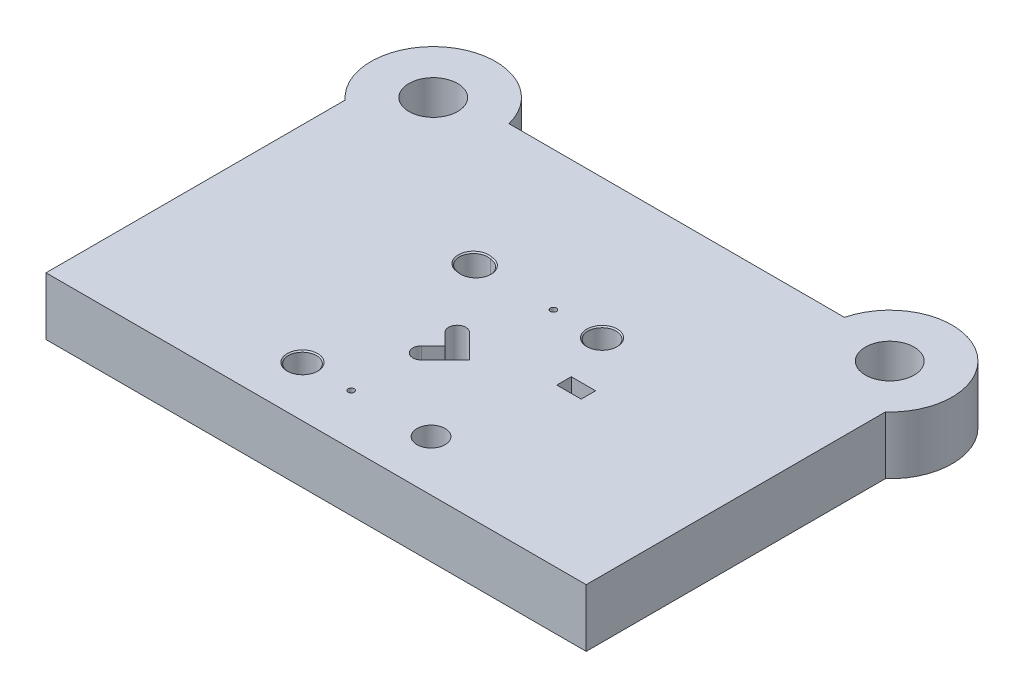
ISO-10303-21;
HEADER;
FILE_DESCRIPTION(('STEP AP214'),'2;1');
FILE_NAME('part.step','',(''),(''),'','','');
FILE_SCHEMA(('AUTOMOTIVE_DESIGN { 1 0 10303 214 1 1 1 1 }'));
ENDSEC;
DATA;
#1=APPLICATION_CONTEXT('core data for automotive mechanical design processes');
#2=APPLICATION_PROTOCOL_DEFINITION('international standard','automotive_design',2000,#1);
#3=PRODUCT_CONTEXT('',#1,'mechanical');
#4=PRODUCT('Part','Part','',(#3));
#5=PRODUCT_RELATED_PRODUCT_CATEGORY('part','',(#4));
#6=PRODUCT_DEFINITION_FORMATION('','',#4);
#7=PRODUCT_DEFINITION_CONTEXT('part definition',#1,'design');
#8=PRODUCT_DEFINITION('design','',#6,#7);
#9=PRODUCT_DEFINITION_SHAPE('','',#8);
#10=(LENGTH_UNIT() NAMED_UNIT(*) SI_UNIT(.MILLI.,.METRE.));
#11=(NAMED_UNIT(*) PLANE_ANGLE_UNIT() SI_UNIT($,.RADIAN.));
#12=(NAMED_UNIT(*) SI_UNIT($,.STERADIAN.) SOLID_ANGLE_UNIT());
#13=UNCERTAINTY_MEASURE_WITH_UNIT(LENGTH_MEASURE(1.E-05),#10,'distance_accuracy_value','');
#14=(GEOMETRIC_REPRESENTATION_CONTEXT(3) GLOBAL_UNCERTAINTY_ASSIGNED_CONTEXT((#13)) GLOBAL_UNIT_ASSIGNED_CONTEXT((#10,
#11,#12)) REPRESENTATION_CONTEXT('',''));
#15=CARTESIAN_POINT('',(0.,0.,0.));
#16=DIRECTION('',(0.,0.,1.));
#17=DIRECTION('',(1.,0.,0.));
#18=AXIS2_PLACEMENT_3D('',#15,#16,#17);
#19=CARTESIAN_POINT('',(-150.,0.,-227.));
#20=DIRECTION('',(0.,1.,0.));
#21=DIRECTION('',(0.,0.,1.));
#22=AXIS2_PLACEMENT_3D('',#19,#20,#21);
#23=PLANE('',#22);
#24=CARTESIAN_POINT('',(-42.25,0.,-33.3));
#25=DIRECTION('',(0.,-1.,0.));
#26=DIRECTION('',(0.,0.,-1.));
#27=AXIS2_PLACEMENT_3D('',#24,#25,#26);
#28=CIRCLE('',#27,9.24999999999999);
#29=CARTESIAN_POINT('',(-42.25,0.,-42.55));
#30=VERTEX_POINT('',#29);
#31=EDGE_CURVE('E437',#30,#30,#28,.T.);
#32=ORIENTED_EDGE('',*,*,#31,.F.);
#33=EDGE_LOOP('',(#32));
#34=FACE_BOUND('',#33,.T.);
#35=CARTESIAN_POINT('',(42.25,0.,-33.3));
#36=DIRECTION('',(0.,-1.,0.));
#37=DIRECTION('',(0.,0.,-1.));
#38=AXIS2_PLACEMENT_3D('',#35,#36,#37);
#39=CIRCLE('',#38,9.24999999999999);
#40=CARTESIAN_POINT('',(42.25,0.,-42.55));
#41=VERTEX_POINT('',#40);
#42=EDGE_CURVE('E434',#41,#41,#39,.T.);
#43=ORIENTED_EDGE('',*,*,#42,.F.);
#44=EDGE_LOOP('',(#43));
#45=FACE_BOUND('',#44,.T.);
#46=CARTESIAN_POINT('',(42.25,0.,-145.68));
#47=DIRECTION('',(0.,-1.,0.));
#48=DIRECTION('',(0.,0.,-1.));
#49=AXIS2_PLACEMENT_3D('',#46,#47,#48);
#50=CIRCLE('',#49,9.24999999999999);
#51=CARTESIAN_POINT('',(42.25,0.,-154.93));
#52=VERTEX_POINT('',#51);
#53=EDGE_CURVE('E428',#52,#52,#50,.T.);
#54=ORIENTED_EDGE('',*,*,#53,.F.);
#55=EDGE_LOOP('',(#54));
#56=FACE_BOUND('',#55,.T.);
#57=CARTESIAN_POINT('',(150.,0.,-227.));
#58=DIRECTION('',(0.,1.,0.));
#59=DIRECTION('',(0.,0.,-1.));
#60=AXIS2_PLACEMENT_3D('',#57,#58,#59);
#61=CIRCLE('',#60,16.);
#62=CARTESIAN_POINT('',(150.,0.,-243.));
#63=VERTEX_POINT('',#62);
#64=EDGE_CURVE('E322',#63,#63,#61,.T.);
#65=ORIENTED_EDGE('',*,*,#64,.T.);
#66=EDGE_LOOP('',(#65));
#67=FACE_BOUND('',#66,.T.);
#68=CARTESIAN_POINT('',(-150.,0.,-227.));
#69=DIRECTION('',(0.,1.,0.));
#70=DIRECTION('',(0.,0.,1.));
#71=AXIS2_PLACEMENT_3D('',#68,#69,#70);
#72=CIRCLE('',#71,16.);
#73=CARTESIAN_POINT('',(-150.,0.,-211.));
#74=VERTEX_POINT('',#73);
#75=EDGE_CURVE('E314',#74,#74,#72,.T.);
#76=ORIENTED_EDGE('',*,*,#75,.T.);
#77=EDGE_LOOP('',(#76));
#78=FACE_BOUND('',#77,.T.);
#79=DIRECTION('',(0.,0.,1.));
#80=VECTOR('',#79,1.);
#81=CARTESIAN_POINT('',(-177.5,0.,0.));
#82=LINE('',#81,#80);
#83=CARTESIAN_POINT('',(-177.5,0.,-196.59029760093));
#84=VERTEX_POINT('',#83);
#85=CARTESIAN_POINT('',(-177.5,0.,0.));
#86=VERTEX_POINT('',#85);
#87=EDGE_CURVE('E271',#84,#86,#82,.T.);
#88=ORIENTED_EDGE('',*,*,#87,.F.);
#89=CARTESIAN_POINT('',(-150.,0.,-227.));
#90=DIRECTION('',(0.,1.,0.));
#91=DIRECTION('',(0.,0.,1.));
#92=AXIS2_PLACEMENT_3D('',#89,#90,#91);
#93=CIRCLE('',#92,41.);
#94=CARTESIAN_POINT('',(-110.238209295858,0.,-237.));
#95=VERTEX_POINT('',#94);
#96=EDGE_CURVE('E287',#95,#84,#93,.T.);
#97=ORIENTED_EDGE('',*,*,#96,.F.);
#98=DIRECTION('',(-1.,0.,0.));
#99=VECTOR('',#98,1.);
#100=CARTESIAN_POINT('',(110.238209295858,0.,-237.));
#101=LINE('',#100,#99);
#102=CARTESIAN_POINT('',(110.238209295858,0.,-237.));
#103=VERTEX_POINT('',#102);
#104=EDGE_CURVE('E282',#103,#95,#101,.T.);
#105=ORIENTED_EDGE('',*,*,#104,.F.);
#106=CARTESIAN_POINT('',(150.,0.,-227.));
#107=DIRECTION('',(0.,1.,0.));
#108=DIRECTION('',(0.,0.,-1.));
#109=AXIS2_PLACEMENT_3D('',#106,#107,#108);
#110=CIRCLE('',#109,41.);
#111=CARTESIAN_POINT('',(177.5,0.,-196.59029760093));
#112=VERTEX_POINT('',#111);
#113=EDGE_CURVE('E280',#112,#103,#110,.T.);
#114=ORIENTED_EDGE('',*,*,#113,.F.);
#115=DIRECTION('',(0.,0.,-1.));
#116=VECTOR('',#115,1.);
#117=CARTESIAN_POINT('',(177.5,0.,0.));
#118=LINE('',#117,#116);
#119=CARTESIAN_POINT('',(177.5,0.,0.));
#120=VERTEX_POINT('',#119);
#121=EDGE_CURVE('E270',#120,#112,#118,.T.);
#122=ORIENTED_EDGE('',*,*,#121,.F.);
#123=DIRECTION('',(1.,0.,0.));
#124=VECTOR('',#123,1.);
#125=CARTESIAN_POINT('',(177.5,0.,0.));
#126=LINE('',#125,#124);
#127=EDGE_CURVE('E262',#86,#120,#126,.T.);
#128=ORIENTED_EDGE('',*,*,#127,.F.);
#129=EDGE_LOOP('',(#88,#97,#105,#114,#122,#128));
#130=FACE_BOUND('',#129,.T.);
#131=CARTESIAN_POINT('',(-10.25,0.,-33.3));
#132=DIRECTION('',(0.,-1.,0.));
#133=DIRECTION('',(0.,0.,-1.));
#134=AXIS2_PLACEMENT_3D('',#131,#132,#133);
#135=CIRCLE('',#134,1.99);
#136=CARTESIAN_POINT('',(-10.25,0.,-35.29));
#137=VERTEX_POINT('',#136);
#138=EDGE_CURVE('E368',#137,#137,#135,.T.);
#139=ORIENTED_EDGE('',*,*,#138,.F.);
#140=EDGE_LOOP('',(#139));
#141=FACE_BOUND('',#140,.T.);
#142=CARTESIAN_POINT('',(10.25,0.,-145.68));
#143=DIRECTION('',(0.,-1.,0.));
#144=DIRECTION('',(0.,0.,-1.));
#145=AXIS2_PLACEMENT_3D('',#142,#143,#144);
#146=CIRCLE('',#145,1.99000000000002);
#147=CARTESIAN_POINT('',(10.25,0.,-147.67));
#148=VERTEX_POINT('',#147);
#149=EDGE_CURVE('E374',#148,#148,#146,.T.);
#150=ORIENTED_EDGE('',*,*,#149,.F.);
#151=EDGE_LOOP('',(#150));
#152=FACE_BOUND('',#151,.T.);
#153=DIRECTION('',(-0.707106781186548,0.,-0.707106781186548));
#154=VECTOR('',#153,1.);
#155=CARTESIAN_POINT('',(-4.81282538143907,0.,-89.5182842712474));
#156=LINE('',#155,#154);
#157=CARTESIAN_POINT('',(-4.81282538143912,0.,-89.5182842712474));
#158=VERTEX_POINT('',#157);
#159=CARTESIAN_POINT('',(-12.5344314319962,0.,-97.2398903218045));
#160=VERTEX_POINT('',#159);
#161=EDGE_CURVE('E407',#158,#160,#156,.T.);
#162=ORIENTED_EDGE('',*,*,#161,.F.);
#163=DIRECTION('',(0.707106781186548,0.,-0.707106781186547));
#164=VECTOR('',#163,1.);
#165=CARTESIAN_POINT('',(-12.5344314319962,0.,-81.7966782206903));
#166=LINE('',#165,#164);
#167=CARTESIAN_POINT('',(-12.5344314319962,0.,-81.7966782206903));
#168=VERTEX_POINT('',#167);
#169=EDGE_CURVE('E380',#168,#158,#166,.T.);
#170=ORIENTED_EDGE('',*,*,#169,.F.);
#171=CARTESIAN_POINT('',(-8.51806491485659,0.,-77.7803117035508));
#172=DIRECTION('',(0.,-1.,0.));
#173=DIRECTION('',(0.,0.,-1.));
#174=AXIS2_PLACEMENT_3D('',#171,#172,#173);
#175=CIRCLE('',#174,5.68);
#176=CARTESIAN_POINT('',(-4.501698397717,0.,-73.7639451864112));
#177=VERTEX_POINT('',#176);
#178=EDGE_CURVE('E394',#177,#168,#175,.T.);
#179=ORIENTED_EDGE('',*,*,#178,.F.);
#180=DIRECTION('',(-0.707106781186547,0.,0.707106781186548));
#181=VECTOR('',#180,1.);
#182=CARTESIAN_POINT('',(11.2526406871193,0.,-89.5182842712474));
#183=LINE('',#182,#181);
#184=CARTESIAN_POINT('',(11.2526406871193,0.,-89.5182842712474));
#185=VERTEX_POINT('',#184);
#186=EDGE_CURVE('E398',#185,#177,#183,.T.);
#187=ORIENTED_EDGE('',*,*,#186,.F.);
#188=DIRECTION('',(0.707106781186547,0.,0.707106781186548));
#189=VECTOR('',#188,1.);
#190=CARTESIAN_POINT('',(-4.50169839771699,0.,-105.272623356084));
#191=LINE('',#190,#189);
#192=CARTESIAN_POINT('',(-4.50169839771699,0.,-105.272623356084));
#193=VERTEX_POINT('',#192);
#194=EDGE_CURVE('E401',#193,#185,#191,.T.);
#195=ORIENTED_EDGE('',*,*,#194,.F.);
#196=CARTESIAN_POINT('',(-8.51806491485659,0.,-101.256256838944));
#197=DIRECTION('',(0.,-1.,0.));
#198=DIRECTION('',(0.,0.,-1.));
#199=AXIS2_PLACEMENT_3D('',#196,#197,#198);
#200=CIRCLE('',#199,5.68000000000001);
#201=EDGE_CURVE('E404',#160,#193,#200,.T.);
#202=ORIENTED_EDGE('',*,*,#201,.F.);
#203=EDGE_LOOP('',(#162,#170,#179,#187,#195,#202));
#204=FACE_BOUND('',#203,.T.);
#205=DIRECTION('',(1.,0.,0.));
#206=VECTOR('',#205,1.);
#207=CARTESIAN_POINT('',(54.25,0.,-113.43));
#208=LINE('',#207,#206);
#209=CARTESIAN_POINT('',(54.25,0.,-113.43));
#210=VERTEX_POINT('',#209);
#211=CARTESIAN_POINT('',(70.25,0.,-113.43));
#212=VERTEX_POINT('',#211);
#213=EDGE_CURVE('E354',#210,#212,#208,.T.);
#214=ORIENTED_EDGE('',*,*,#213,.F.);
#215=DIRECTION('',(0.,0.,-1.));
#216=VECTOR('',#215,1.);
#217=CARTESIAN_POINT('',(54.25,0.,-103.93));
#218=LINE('',#217,#216);
#219=CARTESIAN_POINT('',(54.25,0.,-103.93));
#220=VERTEX_POINT('',#219);
#221=EDGE_CURVE('E357',#220,#210,#218,.T.);
#222=ORIENTED_EDGE('',*,*,#221,.F.);
#223=DIRECTION('',(-1.,0.,0.));
#224=VECTOR('',#223,1.);
#225=CARTESIAN_POINT('',(70.25,0.,-103.93));
#226=LINE('',#225,#224);
#227=CARTESIAN_POINT('',(70.25,0.,-103.93));
#228=VERTEX_POINT('',#227);
#229=EDGE_CURVE('E347',#228,#220,#226,.T.);
#230=ORIENTED_EDGE('',*,*,#229,.F.);
#231=DIRECTION('',(0.,0.,1.));
#232=VECTOR('',#231,1.);
#233=CARTESIAN_POINT('',(70.25,0.,-113.43));
#234=LINE('',#233,#232);
#235=EDGE_CURVE('E351',#212,#228,#234,.T.);
#236=ORIENTED_EDGE('',*,*,#235,.F.);
#237=EDGE_LOOP('',(#214,#222,#230,#236));
#238=FACE_BOUND('',#237,.T.);
#239=CARTESIAN_POINT('',(-42.25,0.,-145.68));
#240=DIRECTION('',(0.,-1.,0.));
#241=DIRECTION('',(0.,0.,-1.));
#242=AXIS2_PLACEMENT_3D('',#239,#240,#241);
#243=CIRCLE('',#242,9.24999999999999);
#244=CARTESIAN_POINT('',(-42.7195034447814,0.,-136.441923007718));
#245=VERTEX_POINT('',#244);
#246=CARTESIAN_POINT('',(-39.9704323244489,0.,-154.644712556049));
#247=VERTEX_POINT('',#246);
#248=EDGE_CURVE('E196',#245,#247,#243,.T.);
#249=ORIENTED_EDGE('',*,*,#248,.F.);
#250=CARTESIAN_POINT('',(-40.4399357692302,0.,-145.406635563767));
#251=DIRECTION('',(0.,1.,0.));
#252=DIRECTION('',(0.,0.,1.));
#253=AXIS2_PLACEMENT_3D('',#250,#251,#252);
#254=CIRCLE('',#253,9.25);
#255=EDGE_CURVE('E191',#245,#247,#254,.T.);
#256=ORIENTED_EDGE('',*,*,#255,.T.);
#257=EDGE_LOOP('',(#249,#256));
#258=FACE_BOUND('',#257,.T.);
#259=ADVANCED_FACE('F35',(#34,#45,#56,#67,#78,#130,#141,#152,#204,#238,#258),#23,.F.);
#260=CARTESIAN_POINT('',(-150.,38.,-227.));
#261=DIRECTION('',(0.,1.,0.));
#262=DIRECTION('',(0.,0.,1.));
#263=AXIS2_PLACEMENT_3D('',#260,#261,#262);
#264=PLANE('',#263);
#265=CARTESIAN_POINT('',(42.25,38.,-145.68));
#266=DIRECTION('',(0.,1.,0.));
#267=DIRECTION('',(0.,0.,1.));
#268=AXIS2_PLACEMENT_3D('',#265,#266,#267);
#269=CIRCLE('',#268,10.025);
#270=CARTESIAN_POINT('',(42.25,38.,-135.655));
#271=VERTEX_POINT('',#270);
#272=EDGE_CURVE('E451',#271,#271,#269,.T.);
#273=ORIENTED_EDGE('',*,*,#272,.F.);
#274=EDGE_LOOP('',(#273));
#275=FACE_BOUND('',#274,.T.);
#276=CARTESIAN_POINT('',(-42.25,38.,-145.68));
#277=DIRECTION('',(0.,1.,0.));
#278=DIRECTION('',(0.,0.,1.));
#279=AXIS2_PLACEMENT_3D('',#276,#277,#278);
#280=CIRCLE('',#279,10.025);
#281=CARTESIAN_POINT('',(-39.8541742036583,38.,-155.41450788451));
#282=VERTEX_POINT('',#281);
#283=CARTESIAN_POINT('',(-42.8357615655719,38.,-135.672127679257));
#284=VERTEX_POINT('',#283);
#285=EDGE_CURVE('E56',#282,#284,#280,.T.);
#286=ORIENTED_EDGE('',*,*,#285,.F.);
#287=CARTESIAN_POINT('',(-40.4399357692302,38.,-145.406635563767));
#288=DIRECTION('',(0.,1.,0.));
#289=DIRECTION('',(0.,0.,1.));
#290=AXIS2_PLACEMENT_3D('',#287,#288,#289);
#291=CIRCLE('',#290,10.025);
#292=EDGE_CURVE('E185',#284,#282,#291,.T.);
#293=ORIENTED_EDGE('',*,*,#292,.F.);
#294=EDGE_LOOP('',(#286,#293));
#295=FACE_BOUND('',#294,.T.);
#296=CARTESIAN_POINT('',(-42.2499999999999,38.,-33.3));
#297=DIRECTION('',(0.,1.,0.));
#298=DIRECTION('',(0.,0.,1.));
#299=AXIS2_PLACEMENT_3D('',#296,#297,#298);
#300=CIRCLE('',#299,10.025);
#301=CARTESIAN_POINT('',(-42.2499999999999,38.,-23.275));
#302=VERTEX_POINT('',#301);
#303=EDGE_CURVE('E176',#302,#302,#300,.T.);
#304=ORIENTED_EDGE('',*,*,#303,.F.);
#305=EDGE_LOOP('',(#304));
#306=FACE_BOUND('',#305,.T.);
#307=CARTESIAN_POINT('',(42.25,38.,-33.3));
#308=DIRECTION('',(0.,-1.,0.));
#309=DIRECTION('',(0.,0.,-1.));
#310=AXIS2_PLACEMENT_3D('',#307,#308,#309);
#311=CIRCLE('',#310,9.24999999999999);
#312=CARTESIAN_POINT('',(42.25,38.,-42.55));
#313=VERTEX_POINT('',#312);
#314=EDGE_CURVE('E431',#313,#313,#311,.T.);
#315=ORIENTED_EDGE('',*,*,#314,.T.);
#316=EDGE_LOOP('',(#315));
#317=FACE_BOUND('',#316,.T.);
#318=DIRECTION('',(0.,0.,-1.));
#319=VECTOR('',#318,1.);
#320=CARTESIAN_POINT('',(54.25,38.,-103.93));
#321=LINE('',#320,#319);
#322=CARTESIAN_POINT('',(54.25,38.,-103.93));
#323=VERTEX_POINT('',#322);
#324=CARTESIAN_POINT('',(54.25,38.,-113.43));
#325=VERTEX_POINT('',#324);
#326=EDGE_CURVE('E350',#323,#325,#321,.T.);
#327=ORIENTED_EDGE('',*,*,#326,.T.);
#328=DIRECTION('',(1.,0.,0.));
#329=VECTOR('',#328,1.);
#330=CARTESIAN_POINT('',(54.25,38.,-113.43));
#331=LINE('',#330,#329);
#332=CARTESIAN_POINT('',(70.25,38.,-113.43));
#333=VERTEX_POINT('',#332);
#334=EDGE_CURVE('E363',#325,#333,#331,.T.);
#335=ORIENTED_EDGE('',*,*,#334,.T.);
#336=DIRECTION('',(0.,0.,1.));
#337=VECTOR('',#336,1.);
#338=CARTESIAN_POINT('',(70.25,38.,-113.43));
#339=LINE('',#338,#337);
#340=CARTESIAN_POINT('',(70.25,38.,-103.93));
#341=VERTEX_POINT('',#340);
#342=EDGE_CURVE('E64',#333,#341,#339,.T.);
#343=ORIENTED_EDGE('',*,*,#342,.T.);
#344=DIRECTION('',(-1.,0.,0.));
#345=VECTOR('',#344,1.);
#346=CARTESIAN_POINT('',(70.25,38.,-103.93));
#347=LINE('',#346,#345);
#348=EDGE_CURVE('E342',#341,#323,#347,.T.);
#349=ORIENTED_EDGE('',*,*,#348,.T.);
#350=EDGE_LOOP('',(#327,#335,#343,#349));
#351=FACE_BOUND('',#350,.T.);
#352=DIRECTION('',(0.707106781186548,0.,-0.707106781186547));
#353=VECTOR('',#352,1.);
#354=CARTESIAN_POINT('',(-12.5344314319962,38.,-81.7966782206903));
#355=LINE('',#354,#353);
#356=CARTESIAN_POINT('',(-12.5344314319962,38.,-81.7966782206903));
#357=VERTEX_POINT('',#356);
#358=CARTESIAN_POINT('',(-4.81282538143907,38.,-89.5182842712474));
#359=VERTEX_POINT('',#358);
#360=EDGE_CURVE('E397',#357,#359,#355,.T.);
#361=ORIENTED_EDGE('',*,*,#360,.T.);
#362=DIRECTION('',(-0.707106781186548,0.,-0.707106781186548));
#363=VECTOR('',#362,1.);
#364=CARTESIAN_POINT('',(-4.81282538143907,38.,-89.5182842712474));
#365=LINE('',#364,#363);
#366=CARTESIAN_POINT('',(-12.5344314319962,38.,-97.2398903218045));
#367=VERTEX_POINT('',#366);
#368=EDGE_CURVE('E422',#359,#367,#365,.T.);
#369=ORIENTED_EDGE('',*,*,#368,.T.);
#370=CARTESIAN_POINT('',(-8.51806491485659,38.,-101.256256838944));
#371=DIRECTION('',(0.,-1.,0.));
#372=DIRECTION('',(0.,0.,-1.));
#373=AXIS2_PLACEMENT_3D('',#370,#371,#372);
#374=CIRCLE('',#373,5.68000000000001);
#375=CARTESIAN_POINT('',(-4.50169839771699,38.,-105.272623356084));
#376=VERTEX_POINT('',#375);
#377=EDGE_CURVE('E419',#367,#376,#374,.T.);
#378=ORIENTED_EDGE('',*,*,#377,.T.);
#379=DIRECTION('',(0.707106781186547,0.,0.707106781186548));
#380=VECTOR('',#379,1.);
#381=CARTESIAN_POINT('',(-4.50169839771699,38.,-105.272623356084));
#382=LINE('',#381,#380);
#383=CARTESIAN_POINT('',(11.2526406871193,38.,-89.5182842712474));
#384=VERTEX_POINT('',#383);
#385=EDGE_CURVE('E416',#376,#384,#382,.T.);
#386=ORIENTED_EDGE('',*,*,#385,.T.);
#387=DIRECTION('',(-0.707106781186547,0.,0.707106781186548));
#388=VECTOR('',#387,1.);
#389=CARTESIAN_POINT('',(11.2526406871193,38.,-89.5182842712474));
#390=LINE('',#389,#388);
#391=CARTESIAN_POINT('',(-4.501698397717,38.,-73.7639451864112));
#392=VERTEX_POINT('',#391);
#393=EDGE_CURVE('E413',#384,#392,#390,.T.);
#394=ORIENTED_EDGE('',*,*,#393,.T.);
#395=CARTESIAN_POINT('',(-8.51806491485659,38.,-77.7803117035508));
#396=DIRECTION('',(0.,-1.,0.));
#397=DIRECTION('',(0.,0.,-1.));
#398=AXIS2_PLACEMENT_3D('',#395,#396,#397);
#399=CIRCLE('',#398,5.68);
#400=EDGE_CURVE('E385',#392,#357,#399,.T.);
#401=ORIENTED_EDGE('',*,*,#400,.T.);
#402=EDGE_LOOP('',(#361,#369,#378,#386,#394,#401));
#403=FACE_BOUND('',#402,.T.);
#404=CARTESIAN_POINT('',(10.25,38.,-145.68));
#405=DIRECTION('',(0.,-1.,0.));
#406=DIRECTION('',(0.,0.,-1.));
#407=AXIS2_PLACEMENT_3D('',#404,#405,#406);
#408=CIRCLE('',#407,1.99000000000002);
#409=CARTESIAN_POINT('',(10.25,38.,-147.67));
#410=VERTEX_POINT('',#409);
#411=EDGE_CURVE('E377',#410,#410,#408,.T.);
#412=ORIENTED_EDGE('',*,*,#411,.T.);
#413=EDGE_LOOP('',(#412));
#414=FACE_BOUND('',#413,.T.);
#415=CARTESIAN_POINT('',(-10.25,38.,-33.3));
#416=DIRECTION('',(0.,-1.,0.));
#417=DIRECTION('',(0.,0.,-1.));
#418=AXIS2_PLACEMENT_3D('',#415,#416,#417);
#419=CIRCLE('',#418,1.99);
#420=CARTESIAN_POINT('',(-10.25,38.,-35.29));
#421=VERTEX_POINT('',#420);
#422=EDGE_CURVE('E371',#421,#421,#419,.T.);
#423=ORIENTED_EDGE('',*,*,#422,.T.);
#424=EDGE_LOOP('',(#423));
#425=FACE_BOUND('',#424,.T.);
#426=CARTESIAN_POINT('',(-150.,38.,-227.));
#427=DIRECTION('',(0.,1.,0.));
#428=DIRECTION('',(0.,0.,1.));
#429=AXIS2_PLACEMENT_3D('',#426,#427,#428);
#430=CIRCLE('',#429,16.);
#431=CARTESIAN_POINT('',(-150.,38.,-211.));
#432=VERTEX_POINT('',#431);
#433=EDGE_CURVE('E312',#432,#432,#430,.T.);
#434=ORIENTED_EDGE('',*,*,#433,.F.);
#435=EDGE_LOOP('',(#434));
#436=FACE_BOUND('',#435,.T.);
#437=DIRECTION('',(0.,0.,1.));
#438=VECTOR('',#437,1.);
#439=CARTESIAN_POINT('',(-177.5,38.,0.));
#440=LINE('',#439,#438);
#441=CARTESIAN_POINT('',(-177.5,38.,-196.59029760093));
#442=VERTEX_POINT('',#441);
#443=CARTESIAN_POINT('',(-177.5,38.,0.));
#444=VERTEX_POINT('',#443);
#445=EDGE_CURVE('E289',#442,#444,#440,.T.);
#446=ORIENTED_EDGE('',*,*,#445,.T.);
#447=DIRECTION('',(1.,0.,0.));
#448=VECTOR('',#447,1.);
#449=CARTESIAN_POINT('',(177.5,38.,0.));
#450=LINE('',#449,#448);
#451=CARTESIAN_POINT('',(177.5,38.,0.));
#452=VERTEX_POINT('',#451);
#453=EDGE_CURVE('E308',#444,#452,#450,.T.);
#454=ORIENTED_EDGE('',*,*,#453,.T.);
#455=DIRECTION('',(0.,0.,-1.));
#456=VECTOR('',#455,1.);
#457=CARTESIAN_POINT('',(177.5,38.,0.));
#458=LINE('',#457,#456);
#459=CARTESIAN_POINT('',(177.5,38.,-196.59029760093));
#460=VERTEX_POINT('',#459);
#461=EDGE_CURVE('E275',#452,#460,#458,.T.);
#462=ORIENTED_EDGE('',*,*,#461,.T.);
#463=CARTESIAN_POINT('',(150.,38.,-227.));
#464=DIRECTION('',(0.,1.,0.));
#465=DIRECTION('',(0.,0.,-1.));
#466=AXIS2_PLACEMENT_3D('',#463,#464,#465);
#467=CIRCLE('',#466,41.);
#468=CARTESIAN_POINT('',(110.238209295858,38.,-237.));
#469=VERTEX_POINT('',#468);
#470=EDGE_CURVE('E302',#460,#469,#467,.T.);
#471=ORIENTED_EDGE('',*,*,#470,.T.);
#472=DIRECTION('',(-1.,0.,0.));
#473=VECTOR('',#472,1.);
#474=CARTESIAN_POINT('',(110.238209295858,38.,-237.));
#475=LINE('',#474,#473);
#476=CARTESIAN_POINT('',(-110.238209295858,38.,-237.));
#477=VERTEX_POINT('',#476);
#478=EDGE_CURVE('E305',#469,#477,#475,.T.);
#479=ORIENTED_EDGE('',*,*,#478,.T.);
#480=CARTESIAN_POINT('',(-150.,38.,-227.));
#481=DIRECTION('',(0.,1.,0.));
#482=DIRECTION('',(0.,0.,1.));
#483=AXIS2_PLACEMENT_3D('',#480,#481,#482);
#484=CIRCLE('',#483,41.);
#485=EDGE_CURVE('E294',#477,#442,#484,.T.);
#486=ORIENTED_EDGE('',*,*,#485,.T.);
#487=EDGE_LOOP('',(#446,#454,#462,#471,#479,#486));
#488=FACE_BOUND('',#487,.T.);
#489=CARTESIAN_POINT('',(150.,38.,-227.));
#490=DIRECTION('',(0.,1.,0.));
#491=DIRECTION('',(0.,0.,-1.));
#492=AXIS2_PLACEMENT_3D('',#489,#490,#491);
#493=CIRCLE('',#492,16.);
#494=CARTESIAN_POINT('',(150.,38.,-243.));
#495=VERTEX_POINT('',#494);
#496=EDGE_CURVE('E319',#495,#495,#493,.T.);
#497=ORIENTED_EDGE('',*,*,#496,.F.);
#498=EDGE_LOOP('',(#497));
#499=FACE_BOUND('',#498,.T.);
#500=ADVANCED_FACE('F225',(#275,#295,#306,#317,#351,#403,#414,#425,#436,#488,#499),#264,.T.);
#501=CARTESIAN_POINT('',(-177.5,38.,0.));
#502=DIRECTION('',(1.,0.,0.));
#503=DIRECTION('',(0.,0.,-1.));
#504=AXIS2_PLACEMENT_3D('',#501,#502,#503);
#505=PLANE('',#504);
#506=ORIENTED_EDGE('',*,*,#87,.T.);
#507=DIRECTION('',(0.,-1.,0.));
#508=VECTOR('',#507,1.);
#509=CARTESIAN_POINT('',(-177.5,38.,0.));
#510=LINE('',#509,#508);
#511=EDGE_CURVE('E197',#444,#86,#510,.T.);
#512=ORIENTED_EDGE('',*,*,#511,.F.);
#513=ORIENTED_EDGE('',*,*,#445,.F.);
#514=DIRECTION('',(0.,-1.,0.));
#515=VECTOR('',#514,1.);
#516=CARTESIAN_POINT('',(-177.5,38.,-196.59029760093));
#517=LINE('',#516,#515);
#518=EDGE_CURVE('E290',#442,#84,#517,.T.);
#519=ORIENTED_EDGE('',*,*,#518,.T.);
#520=EDGE_LOOP('',(#506,#512,#513,#519));
#521=FACE_BOUND('',#520,.T.);
#522=ADVANCED_FACE('F37',(#521),#505,.F.);
#523=CARTESIAN_POINT('',(177.5,38.,0.));
#524=DIRECTION('',(0.,0.,-1.));
#525=DIRECTION('',(-1.,0.,0.));
#526=AXIS2_PLACEMENT_3D('',#523,#524,#525);
#527=PLANE('',#526);
#528=ORIENTED_EDGE('',*,*,#127,.T.);
#529=DIRECTION('',(0.,-1.,0.));
#530=VECTOR('',#529,1.);
#531=CARTESIAN_POINT('',(177.5,38.,0.));
#532=LINE('',#531,#530);
#533=EDGE_CURVE('E201',#452,#120,#532,.T.);
#534=ORIENTED_EDGE('',*,*,#533,.F.);
#535=ORIENTED_EDGE('',*,*,#453,.F.);
#536=ORIENTED_EDGE('',*,*,#511,.T.);
#537=EDGE_LOOP('',(#528,#534,#535,#536));
#538=FACE_BOUND('',#537,.T.);
#539=ADVANCED_FACE('F253',(#538),#527,.F.);
#540=CARTESIAN_POINT('',(177.5,38.,0.));
#541=DIRECTION('',(-1.,0.,0.));
#542=DIRECTION('',(0.,0.,1.));
#543=AXIS2_PLACEMENT_3D('',#540,#541,#542);
#544=PLANE('',#543);
#545=ORIENTED_EDGE('',*,*,#121,.T.);
#546=DIRECTION('',(0.,-1.,0.));
#547=VECTOR('',#546,1.);
#548=CARTESIAN_POINT('',(177.5,38.,-196.59029760093));
#549=LINE('',#548,#547);
#550=EDGE_CURVE('E276',#460,#112,#549,.T.);
#551=ORIENTED_EDGE('',*,*,#550,.F.);
#552=ORIENTED_EDGE('',*,*,#461,.F.);
#553=ORIENTED_EDGE('',*,*,#533,.T.);
#554=EDGE_LOOP('',(#545,#551,#552,#553));
#555=FACE_BOUND('',#554,.T.);
#556=ADVANCED_FACE('F250',(#555),#544,.F.);
#557=CARTESIAN_POINT('',(150.,38.,-227.));
#558=DIRECTION('',(0.,-1.,0.));
#559=DIRECTION('',(0.,0.,-1.));
#560=AXIS2_PLACEMENT_3D('',#557,#558,#559);
#561=CYLINDRICAL_SURFACE('',#560,41.);
#562=ORIENTED_EDGE('',*,*,#113,.T.);
#563=DIRECTION('',(0.,-1.,0.));
#564=VECTOR('',#563,1.);
#565=CARTESIAN_POINT('',(110.238209295858,38.,-237.));
#566=LINE('',#565,#564);
#567=EDGE_CURVE('E297',#469,#103,#566,.T.);
#568=ORIENTED_EDGE('',*,*,#567,.F.);
#569=ORIENTED_EDGE('',*,*,#470,.F.);
#570=ORIENTED_EDGE('',*,*,#550,.T.);
#571=EDGE_LOOP('',(#562,#568,#569,#570));
#572=FACE_BOUND('',#571,.T.);
#573=ADVANCED_FACE('F246',(#572),#561,.T.);
#574=CARTESIAN_POINT('',(110.238209295858,38.,-237.));
#575=DIRECTION('',(0.,0.,1.));
#576=DIRECTION('',(1.,0.,0.));
#577=AXIS2_PLACEMENT_3D('',#574,#575,#576);
#578=PLANE('',#577);
#579=ORIENTED_EDGE('',*,*,#104,.T.);
#580=DIRECTION('',(0.,-1.,0.));
#581=VECTOR('',#580,1.);
#582=CARTESIAN_POINT('',(-110.238209295858,38.,-237.));
#583=LINE('',#582,#581);
#584=EDGE_CURVE('E293',#477,#95,#583,.T.);
#585=ORIENTED_EDGE('',*,*,#584,.F.);
#586=ORIENTED_EDGE('',*,*,#478,.F.);
#587=ORIENTED_EDGE('',*,*,#567,.T.);
#588=EDGE_LOOP('',(#579,#585,#586,#587));
#589=FACE_BOUND('',#588,.T.);
#590=ADVANCED_FACE('F242',(#589),#578,.F.);
#591=CARTESIAN_POINT('',(-150.,38.,-227.));
#592=DIRECTION('',(0.,-1.,0.));
#593=DIRECTION('',(0.,0.,-1.));
#594=AXIS2_PLACEMENT_3D('',#591,#592,#593);
#595=CYLINDRICAL_SURFACE('',#594,41.);
#596=ORIENTED_EDGE('',*,*,#96,.T.);
#597=ORIENTED_EDGE('',*,*,#518,.F.);
#598=ORIENTED_EDGE('',*,*,#485,.F.);
#599=ORIENTED_EDGE('',*,*,#584,.T.);
#600=EDGE_LOOP('',(#596,#597,#598,#599));
#601=FACE_BOUND('',#600,.T.);
#602=ADVANCED_FACE('F238',(#601),#595,.T.);
#603=CARTESIAN_POINT('',(-150.,38.,-227.));
#604=DIRECTION('',(0.,-1.,0.));
#605=DIRECTION('',(0.,0.,-1.));
#606=AXIS2_PLACEMENT_3D('',#603,#604,#605);
#607=CYLINDRICAL_SURFACE('',#606,16.);
#608=ORIENTED_EDGE('',*,*,#433,.T.);
#609=EDGE_LOOP('',(#608));
#610=FACE_BOUND('',#609,.T.);
#611=ORIENTED_EDGE('',*,*,#75,.F.);
#612=EDGE_LOOP('',(#611));
#613=FACE_BOUND('',#612,.T.);
#614=ADVANCED_FACE('F241',(#610,#613),#607,.F.);
#615=CARTESIAN_POINT('',(150.,38.,-227.));
#616=DIRECTION('',(0.,-1.,0.));
#617=DIRECTION('',(0.,0.,-1.));
#618=AXIS2_PLACEMENT_3D('',#615,#616,#617);
#619=CYLINDRICAL_SURFACE('',#618,16.);
#620=ORIENTED_EDGE('',*,*,#496,.T.);
#621=EDGE_LOOP('',(#620));
#622=FACE_BOUND('',#621,.T.);
#623=ORIENTED_EDGE('',*,*,#64,.F.);
#624=EDGE_LOOP('',(#623));
#625=FACE_BOUND('',#624,.T.);
#626=ADVANCED_FACE('F474',(#622,#625),#619,.F.);
#627=CARTESIAN_POINT('',(-10.25,38.,-33.3));
#628=DIRECTION('',(0.,-1.,0.));
#629=DIRECTION('',(0.,0.,-1.));
#630=AXIS2_PLACEMENT_3D('',#627,#628,#629);
#631=CYLINDRICAL_SURFACE('',#630,1.99);
#632=ORIENTED_EDGE('',*,*,#422,.F.);
#633=EDGE_LOOP('',(#632));
#634=FACE_BOUND('',#633,.T.);
#635=ORIENTED_EDGE('',*,*,#138,.T.);
#636=EDGE_LOOP('',(#635));
#637=FACE_BOUND('',#636,.T.);
#638=ADVANCED_FACE('F470',(#634,#637),#631,.F.);
#639=CARTESIAN_POINT('',(10.25,38.,-145.68));
#640=DIRECTION('',(0.,-1.,0.));
#641=DIRECTION('',(0.,0.,-1.));
#642=AXIS2_PLACEMENT_3D('',#639,#640,#641);
#643=CYLINDRICAL_SURFACE('',#642,1.99000000000002);
#644=ORIENTED_EDGE('',*,*,#411,.F.);
#645=EDGE_LOOP('',(#644));
#646=FACE_BOUND('',#645,.T.);
#647=ORIENTED_EDGE('',*,*,#149,.T.);
#648=EDGE_LOOP('',(#647));
#649=FACE_BOUND('',#648,.T.);
#650=ADVANCED_FACE('F473',(#646,#649),#643,.F.);
#651=CARTESIAN_POINT('',(-12.5344314319962,38.,-81.7966782206903));
#652=DIRECTION('',(-0.707106781186547,0.,-0.707106781186548));
#653=DIRECTION('',(-0.707106781186548,0.,0.707106781186547));
#654=AXIS2_PLACEMENT_3D('',#651,#652,#653);
#655=PLANE('',#654);
#656=ORIENTED_EDGE('',*,*,#169,.T.);
#657=DIRECTION('',(0.,-1.,0.));
#658=VECTOR('',#657,1.);
#659=CARTESIAN_POINT('',(-4.81282538143907,38.,-89.5182842712474));
#660=LINE('',#659,#658);
#661=EDGE_CURVE('E381',#359,#158,#660,.T.);
#662=ORIENTED_EDGE('',*,*,#661,.F.);
#663=ORIENTED_EDGE('',*,*,#360,.F.);
#664=DIRECTION('',(0.,-1.,0.));
#665=VECTOR('',#664,1.);
#666=CARTESIAN_POINT('',(-12.5344314319962,38.,-81.7966782206903));
#667=LINE('',#666,#665);
#668=EDGE_CURVE('E359',#357,#168,#667,.T.);
#669=ORIENTED_EDGE('',*,*,#668,.T.);
#670=EDGE_LOOP('',(#656,#662,#663,#669));
#671=FACE_BOUND('',#670,.T.);
#672=ADVANCED_FACE('F539',(#671),#655,.F.);
#673=CARTESIAN_POINT('',(-8.51806491485659,38.,-77.7803117035508));
#674=DIRECTION('',(0.,-1.,0.));
#675=DIRECTION('',(0.,0.,-1.));
#676=AXIS2_PLACEMENT_3D('',#673,#674,#675);
#677=CYLINDRICAL_SURFACE('',#676,5.68);
#678=ORIENTED_EDGE('',*,*,#178,.T.);
#679=ORIENTED_EDGE('',*,*,#668,.F.);
#680=ORIENTED_EDGE('',*,*,#400,.F.);
#681=DIRECTION('',(0.,-1.,0.));
#682=VECTOR('',#681,1.);
#683=CARTESIAN_POINT('',(-4.501698397717,38.,-73.7639451864112));
#684=LINE('',#683,#682);
#685=EDGE_CURVE('E391',#392,#177,#684,.T.);
#686=ORIENTED_EDGE('',*,*,#685,.T.);
#687=EDGE_LOOP('',(#678,#679,#680,#686));
#688=FACE_BOUND('',#687,.T.);
#689=ADVANCED_FACE('F547',(#688),#677,.F.);
#690=CARTESIAN_POINT('',(11.2526406871193,38.,-89.5182842712474));
#691=DIRECTION('',(0.707106781186548,0.,0.707106781186547));
#692=DIRECTION('',(0.707106781186547,0.,-0.707106781186548));
#693=AXIS2_PLACEMENT_3D('',#690,#691,#692);
#694=PLANE('',#693);
#695=ORIENTED_EDGE('',*,*,#186,.T.);
#696=ORIENTED_EDGE('',*,*,#685,.F.);
#697=ORIENTED_EDGE('',*,*,#393,.F.);
#698=DIRECTION('',(0.,-1.,0.));
#699=VECTOR('',#698,1.);
#700=CARTESIAN_POINT('',(11.2526406871193,38.,-89.5182842712474));
#701=LINE('',#700,#699);
#702=EDGE_CURVE('E389',#384,#185,#701,.T.);
#703=ORIENTED_EDGE('',*,*,#702,.T.);
#704=EDGE_LOOP('',(#695,#696,#697,#703));
#705=FACE_BOUND('',#704,.T.);
#706=ADVANCED_FACE('F555',(#705),#694,.F.);
#707=CARTESIAN_POINT('',(-4.50169839771699,38.,-105.272623356084));
#708=DIRECTION('',(0.707106781186548,0.,-0.707106781186547));
#709=DIRECTION('',(-0.707106781186547,0.,-0.707106781186548));
#710=AXIS2_PLACEMENT_3D('',#707,#708,#709);
#711=PLANE('',#710);
#712=ORIENTED_EDGE('',*,*,#194,.T.);
#713=ORIENTED_EDGE('',*,*,#702,.F.);
#714=ORIENTED_EDGE('',*,*,#385,.F.);
#715=DIRECTION('',(0.,-1.,0.));
#716=VECTOR('',#715,1.);
#717=CARTESIAN_POINT('',(-4.50169839771699,38.,-105.272623356084));
#718=LINE('',#717,#716);
#719=EDGE_CURVE('E387',#376,#193,#718,.T.);
#720=ORIENTED_EDGE('',*,*,#719,.T.);
#721=EDGE_LOOP('',(#712,#713,#714,#720));
#722=FACE_BOUND('',#721,.T.);
#723=ADVANCED_FACE('F563',(#722),#711,.F.);
#724=CARTESIAN_POINT('',(-8.51806491485659,38.,-101.256256838944));
#725=DIRECTION('',(0.,-1.,0.));
#726=DIRECTION('',(0.,0.,-1.));
#727=AXIS2_PLACEMENT_3D('',#724,#725,#726);
#728=CYLINDRICAL_SURFACE('',#727,5.68000000000001);
#729=ORIENTED_EDGE('',*,*,#201,.T.);
#730=ORIENTED_EDGE('',*,*,#719,.F.);
#731=ORIENTED_EDGE('',*,*,#377,.F.);
#732=DIRECTION('',(0.,-1.,0.));
#733=VECTOR('',#732,1.);
#734=CARTESIAN_POINT('',(-12.5344314319962,38.,-97.2398903218045));
#735=LINE('',#734,#733);
#736=EDGE_CURVE('E384',#367,#160,#735,.T.);
#737=ORIENTED_EDGE('',*,*,#736,.T.);
#738=EDGE_LOOP('',(#729,#730,#731,#737));
#739=FACE_BOUND('',#738,.T.);
#740=ADVANCED_FACE('F571',(#739),#728,.F.);
#741=CARTESIAN_POINT('',(-4.81282538143907,38.,-89.5182842712474));
#742=DIRECTION('',(-0.707106781186548,0.,0.707106781186548));
#743=DIRECTION('',(0.707106781186548,0.,0.707106781186548));
#744=AXIS2_PLACEMENT_3D('',#741,#742,#743);
#745=PLANE('',#744);
#746=ORIENTED_EDGE('',*,*,#161,.T.);
#747=ORIENTED_EDGE('',*,*,#736,.F.);
#748=ORIENTED_EDGE('',*,*,#368,.F.);
#749=ORIENTED_EDGE('',*,*,#661,.T.);
#750=EDGE_LOOP('',(#746,#747,#748,#749));
#751=FACE_BOUND('',#750,.T.);
#752=ADVANCED_FACE('F509',(#751),#745,.F.);
#753=CARTESIAN_POINT('',(54.25,38.,-103.93));
#754=DIRECTION('',(-1.,0.,0.));
#755=DIRECTION('',(0.,0.,1.));
#756=AXIS2_PLACEMENT_3D('',#753,#754,#755);
#757=PLANE('',#756);
#758=ORIENTED_EDGE('',*,*,#221,.T.);
#759=DIRECTION('',(0.,-1.,0.));
#760=VECTOR('',#759,1.);
#761=CARTESIAN_POINT('',(54.25,38.,-113.43));
#762=LINE('',#761,#760);
#763=EDGE_CURVE('E338',#325,#210,#762,.T.);
#764=ORIENTED_EDGE('',*,*,#763,.F.);
#765=ORIENTED_EDGE('',*,*,#326,.F.);
#766=DIRECTION('',(0.,-1.,0.));
#767=VECTOR('',#766,1.);
#768=CARTESIAN_POINT('',(54.25,38.,-103.93));
#769=LINE('',#768,#767);
#770=EDGE_CURVE('E336',#323,#220,#769,.T.);
#771=ORIENTED_EDGE('',*,*,#770,.T.);
#772=EDGE_LOOP('',(#758,#764,#765,#771));
#773=FACE_BOUND('',#772,.T.);
#774=ADVANCED_FACE('F493',(#773),#757,.F.);
#775=CARTESIAN_POINT('',(70.25,38.,-103.93));
#776=DIRECTION('',(0.,0.,1.));
#777=DIRECTION('',(1.,0.,0.));
#778=AXIS2_PLACEMENT_3D('',#775,#776,#777);
#779=PLANE('',#778);
#780=ORIENTED_EDGE('',*,*,#229,.T.);
#781=ORIENTED_EDGE('',*,*,#770,.F.);
#782=ORIENTED_EDGE('',*,*,#348,.F.);
#783=DIRECTION('',(0.,-1.,0.));
#784=VECTOR('',#783,1.);
#785=CARTESIAN_POINT('',(70.25,38.,-103.93));
#786=LINE('',#785,#784);
#787=EDGE_CURVE('E344',#341,#228,#786,.T.);
#788=ORIENTED_EDGE('',*,*,#787,.T.);
#789=EDGE_LOOP('',(#780,#781,#782,#788));
#790=FACE_BOUND('',#789,.T.);
#791=ADVANCED_FACE('F496',(#790),#779,.F.);
#792=CARTESIAN_POINT('',(70.25,38.,-113.43));
#793=DIRECTION('',(1.,0.,0.));
#794=DIRECTION('',(0.,0.,-1.));
#795=AXIS2_PLACEMENT_3D('',#792,#793,#794);
#796=PLANE('',#795);
#797=ORIENTED_EDGE('',*,*,#235,.T.);
#798=ORIENTED_EDGE('',*,*,#787,.F.);
#799=ORIENTED_EDGE('',*,*,#342,.F.);
#800=DIRECTION('',(0.,-1.,0.));
#801=VECTOR('',#800,1.);
#802=CARTESIAN_POINT('',(70.25,38.,-113.43));
#803=LINE('',#802,#801);
#804=EDGE_CURVE('E341',#333,#212,#803,.T.);
#805=ORIENTED_EDGE('',*,*,#804,.T.);
#806=EDGE_LOOP('',(#797,#798,#799,#805));
#807=FACE_BOUND('',#806,.T.);
#808=ADVANCED_FACE('F497',(#807),#796,.F.);
#809=CARTESIAN_POINT('',(54.25,38.,-113.43));
#810=DIRECTION('',(0.,0.,-1.));
#811=DIRECTION('',(-1.,0.,0.));
#812=AXIS2_PLACEMENT_3D('',#809,#810,#811);
#813=PLANE('',#812);
#814=ORIENTED_EDGE('',*,*,#213,.T.);
#815=ORIENTED_EDGE('',*,*,#804,.F.);
#816=ORIENTED_EDGE('',*,*,#334,.F.);
#817=ORIENTED_EDGE('',*,*,#763,.T.);
#818=EDGE_LOOP('',(#814,#815,#816,#817));
#819=FACE_BOUND('',#818,.T.);
#820=ADVANCED_FACE('F490',(#819),#813,.F.);
#821=CARTESIAN_POINT('',(-42.25,0.,-145.68));
#822=DIRECTION('',(0.,-1.,0.));
#823=DIRECTION('',(0.,0.,-1.));
#824=AXIS2_PLACEMENT_3D('',#821,#822,#823);
#825=CYLINDRICAL_SURFACE('',#824,9.24999999999999);
#826=DIRECTION('',(0.,1.,0.));
#827=VECTOR('',#826,1.);
#828=CARTESIAN_POINT('',(-39.9704323244489,18.6125,-154.644712556049));
#829=LINE('',#828,#827);
#830=CARTESIAN_POINT('',(-39.9704323244491,37.225,-154.644712556049));
#831=VERTEX_POINT('',#830);
#832=EDGE_CURVE('E188',#247,#831,#829,.T.);
#833=ORIENTED_EDGE('',*,*,#832,.T.);
#834=CARTESIAN_POINT('',(-42.25,37.225,-145.68));
#835=DIRECTION('',(0.,1.,0.));
#836=DIRECTION('',(0.,0.,1.));
#837=AXIS2_PLACEMENT_3D('',#834,#835,#836);
#838=CIRCLE('',#837,9.24999999999999);
#839=CARTESIAN_POINT('',(-42.7195034447811,37.225,-136.441923007717));
#840=VERTEX_POINT('',#839);
#841=EDGE_CURVE('E170',#831,#840,#838,.T.);
#842=ORIENTED_EDGE('',*,*,#841,.T.);
#843=DIRECTION('',(0.,1.,0.));
#844=VECTOR('',#843,1.);
#845=CARTESIAN_POINT('',(-42.7195034447814,18.6125,-136.441923007718));
#846=LINE('',#845,#844);
#847=EDGE_CURVE('E190',#840,#245,#846,.F.);
#848=ORIENTED_EDGE('',*,*,#847,.T.);
#849=ORIENTED_EDGE('',*,*,#248,.T.);
#850=EDGE_LOOP('',(#833,#842,#848,#849));
#851=FACE_BOUND('',#850,.T.);
#852=ADVANCED_FACE('F194',(#851),#825,.F.);
#853=CARTESIAN_POINT('',(42.25,0.,-145.68));
#854=DIRECTION('',(0.,-1.,0.));
#855=DIRECTION('',(0.,0.,-1.));
#856=AXIS2_PLACEMENT_3D('',#853,#854,#855);
#857=CYLINDRICAL_SURFACE('',#856,9.24999999999999);
#858=CARTESIAN_POINT('',(42.25,37.225,-145.68));
#859=DIRECTION('',(0.,1.,0.));
#860=DIRECTION('',(0.,0.,1.));
#861=AXIS2_PLACEMENT_3D('',#858,#859,#860);
#862=CIRCLE('',#861,9.24999999999999);
#863=CARTESIAN_POINT('',(42.25,37.225,-136.43));
#864=VERTEX_POINT('',#863);
#865=EDGE_CURVE('E448',#864,#864,#862,.T.);
#866=ORIENTED_EDGE('',*,*,#865,.T.);
#867=EDGE_LOOP('',(#866));
#868=FACE_BOUND('',#867,.T.);
#869=ORIENTED_EDGE('',*,*,#53,.T.);
#870=EDGE_LOOP('',(#869));
#871=FACE_BOUND('',#870,.T.);
#872=ADVANCED_FACE('F615',(#868,#871),#857,.F.);
#873=CARTESIAN_POINT('',(42.25,0.,-33.3));
#874=DIRECTION('',(0.,-1.,0.));
#875=DIRECTION('',(0.,0.,-1.));
#876=AXIS2_PLACEMENT_3D('',#873,#874,#875);
#877=CYLINDRICAL_SURFACE('',#876,9.24999999999999);
#878=ORIENTED_EDGE('',*,*,#314,.F.);
#879=EDGE_LOOP('',(#878));
#880=FACE_BOUND('',#879,.T.);
#881=ORIENTED_EDGE('',*,*,#42,.T.);
#882=EDGE_LOOP('',(#881));
#883=FACE_BOUND('',#882,.T.);
#884=ADVANCED_FACE('F609',(#880,#883),#877,.F.);
#885=CARTESIAN_POINT('',(-42.25,0.,-33.3));
#886=DIRECTION('',(0.,-1.,0.));
#887=DIRECTION('',(0.,0.,-1.));
#888=AXIS2_PLACEMENT_3D('',#885,#886,#887);
#889=CYLINDRICAL_SURFACE('',#888,9.24999999999999);
#890=CARTESIAN_POINT('',(-42.2499999999999,37.225,-33.3));
#891=DIRECTION('',(0.,1.,0.));
#892=DIRECTION('',(0.,0.,1.));
#893=AXIS2_PLACEMENT_3D('',#890,#891,#892);
#894=CIRCLE('',#893,9.24999999999999);
#895=CARTESIAN_POINT('',(-42.2499999999999,37.225,-24.05));
#896=VERTEX_POINT('',#895);
#897=EDGE_CURVE('E442',#896,#896,#894,.T.);
#898=ORIENTED_EDGE('',*,*,#897,.T.);
#899=EDGE_LOOP('',(#898));
#900=FACE_BOUND('',#899,.T.);
#901=ORIENTED_EDGE('',*,*,#31,.T.);
#902=EDGE_LOOP('',(#901));
#903=FACE_BOUND('',#902,.T.);
#904=ADVANCED_FACE('F614',(#900,#903),#889,.F.);
#905=CARTESIAN_POINT('',(-40.4399357692302,38.,-145.406635563767));
#906=DIRECTION('',(0.,1.,0.));
#907=DIRECTION('',(0.,0.,1.));
#908=AXIS2_PLACEMENT_3D('',#905,#906,#907);
#909=CYLINDRICAL_SURFACE('',#908,9.25);
#910=CARTESIAN_POINT('',(-40.4399357692302,37.225,-145.406635563767));
#911=DIRECTION('',(0.,1.,0.));
#912=DIRECTION('',(0.,0.,1.));
#913=AXIS2_PLACEMENT_3D('',#910,#911,#912);
#914=CIRCLE('',#913,9.25);
#915=EDGE_CURVE('E183',#840,#831,#914,.T.);
#916=ORIENTED_EDGE('',*,*,#915,.T.);
#917=ORIENTED_EDGE('',*,*,#832,.F.);
#918=ORIENTED_EDGE('',*,*,#255,.F.);
#919=ORIENTED_EDGE('',*,*,#847,.F.);
#920=EDGE_LOOP('',(#916,#917,#918,#919));
#921=FACE_BOUND('',#920,.T.);
#922=ADVANCED_FACE('F187',(#921),#909,.F.);
#923=CARTESIAN_POINT('',(-40.4399357692302,38.,-145.406635563767));
#924=DIRECTION('',(0.,1.,0.));
#925=DIRECTION('',(0.,0.,1.));
#926=AXIS2_PLACEMENT_3D('',#923,#924,#925);
#927=CONICAL_SURFACE('',#926,10.025,0.785398163397448);
#928=ORIENTED_EDGE('',*,*,#292,.T.);
#929=CARTESIAN_POINT('',(-39.854144212134,38.0002,-155.414706471371));
#930=CARTESIAN_POINT('',(-39.8735270275495,37.8709428606787,-155.286364462591));
#931=CARTESIAN_POINT('',(-39.8929116124104,37.7416976243732,-155.158010737547));
#932=CARTESIAN_POINT('',(-39.931684321036,37.4832309577065,-154.901279854846));
#933=CARTESIAN_POINT('',(-39.9510724448007,37.3540095273453,-154.772902697189));
#934=CARTESIAN_POINT('',(-39.9704623380107,37.2248,-154.644513823268));
#935=B_SPLINE_CURVE_WITH_KNOTS('',3,(#929,#930,#931,#932,#933,#934),.UNSPECIFIED.,.F.,.F.,(4,2,
4),(0.,0.549538850067981,1.09907770050767),.UNSPECIFIED.);
#936=EDGE_CURVE('E11',#282,#831,#935,.T.);
#937=ORIENTED_EDGE('',*,*,#936,.T.);
#938=ORIENTED_EDGE('',*,*,#915,.F.);
#939=CARTESIAN_POINT('',(-42.7194734312194,37.2248,-136.442121740498));
#940=CARTESIAN_POINT('',(-42.7388633244295,37.3540095273453,-136.313732866577));
#941=CARTESIAN_POINT('',(-42.7582514481942,37.4832309577065,-136.18535570892));
#942=CARTESIAN_POINT('',(-42.7970241568197,37.7416976243732,-135.928624826219));
#943=CARTESIAN_POINT('',(-42.8164087416806,37.8709428606787,-135.800271101176));
#944=CARTESIAN_POINT('',(-42.8357915570962,38.0002,-135.671929092396));
#945=B_SPLINE_CURVE_WITH_KNOTS('',3,(#939,#940,#941,#942,#943,#944),.UNSPECIFIED.,.F.,.F.,(4,2,
4),(0.,0.549538850439722,1.09907770050773),.UNSPECIFIED.);
#946=EDGE_CURVE('E49',#840,#284,#945,.T.);
#947=ORIENTED_EDGE('',*,*,#946,.T.);
#948=EDGE_LOOP('',(#928,#937,#938,#947));
#949=FACE_BOUND('',#948,.T.);
#950=ADVANCED_FACE('F182',(#949),#927,.F.);
#951=CARTESIAN_POINT('',(-42.2499999999999,38.,-33.3));
#952=DIRECTION('',(0.,1.,0.));
#953=DIRECTION('',(0.,0.,1.));
#954=AXIS2_PLACEMENT_3D('',#951,#952,#953);
#955=CONICAL_SURFACE('',#954,10.025,0.785398163397448);
#956=ORIENTED_EDGE('',*,*,#897,.F.);
#957=EDGE_LOOP('',(#956));
#958=FACE_BOUND('',#957,.T.);
#959=ORIENTED_EDGE('',*,*,#303,.T.);
#960=EDGE_LOOP('',(#959));
#961=FACE_BOUND('',#960,.T.);
#962=ADVANCED_FACE('F215',(#958,#961),#955,.F.);
#963=CARTESIAN_POINT('',(-42.25,38.,-145.68));
#964=DIRECTION('',(0.,1.,0.));
#965=DIRECTION('',(0.,0.,1.));
#966=AXIS2_PLACEMENT_3D('',#963,#964,#965);
#967=CONICAL_SURFACE('',#966,10.025,0.785398163397448);
#968=ORIENTED_EDGE('',*,*,#285,.T.);
#969=ORIENTED_EDGE('',*,*,#946,.F.);
#970=ORIENTED_EDGE('',*,*,#841,.F.);
#971=ORIENTED_EDGE('',*,*,#936,.F.);
#972=EDGE_LOOP('',(#968,#969,#970,#971));
#973=FACE_BOUND('',#972,.T.);
#974=ADVANCED_FACE('F171',(#973),#967,.F.);
#975=CARTESIAN_POINT('',(42.25,38.,-145.68));
#976=DIRECTION('',(0.,1.,0.));
#977=DIRECTION('',(0.,0.,1.));
#978=AXIS2_PLACEMENT_3D('',#975,#976,#977);
#979=CONICAL_SURFACE('',#978,10.025,0.785398163397448);
#980=ORIENTED_EDGE('',*,*,#865,.F.);
#981=EDGE_LOOP('',(#980));
#982=FACE_BOUND('',#981,.T.);
#983=ORIENTED_EDGE('',*,*,#272,.T.);
#984=EDGE_LOOP('',(#983));
#985=FACE_BOUND('',#984,.T.);
#986=ADVANCED_FACE('F214',(#982,#985),#979,.F.);
#987=CLOSED_SHELL('',(#259,#500,#522,#539,#556,#573,#590,#602,#614,#626,#638,#650,#672,#689,
#706,#723,#740,#752,#774,#791,#808,#820,#852,#872,#884,#904,#922,#950,#962,#974,#986));
#988=MANIFOLD_SOLID_BREP('B2',#987);
#989=ADVANCED_BREP_SHAPE_REPRESENTATION('',(#18,#988),#14);
#990=SHAPE_DEFINITION_REPRESENTATION(#9,#989);
ENDSEC;
END-ISO-10303-21;
